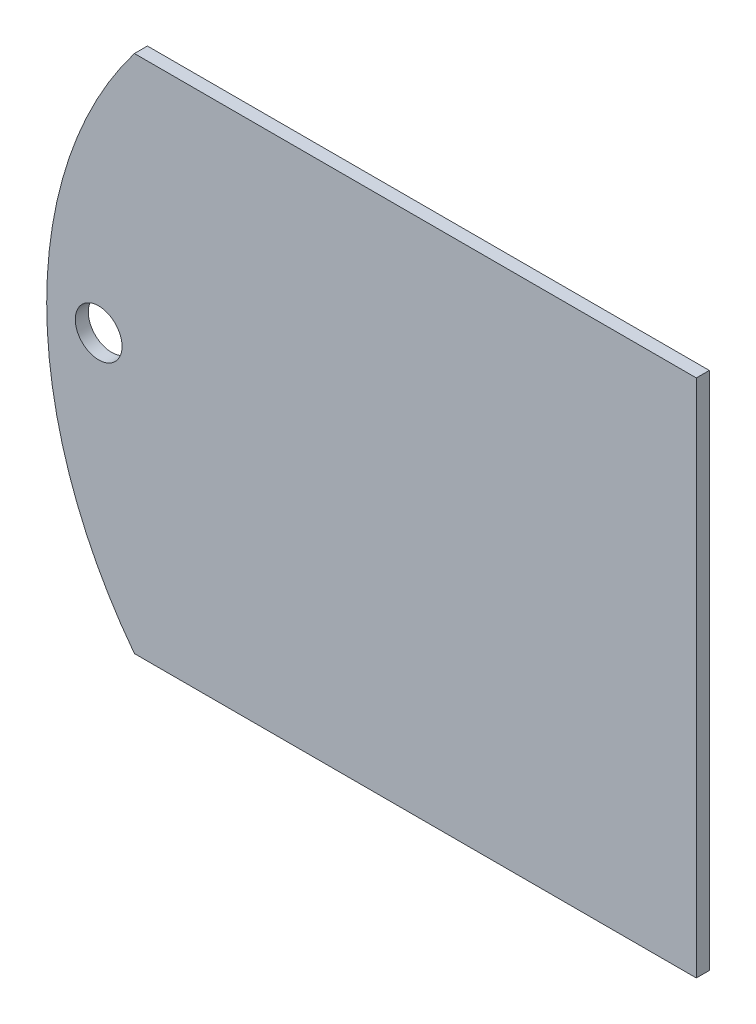
ISO-10303-21;
HEADER;
FILE_DESCRIPTION(('STEP AP214'),'2;1');
FILE_NAME('part.step','',(''),(''),'','','');
FILE_SCHEMA(('AUTOMOTIVE_DESIGN { 1 0 10303 214 1 1 1 1 }'));
ENDSEC;
DATA;
#1=APPLICATION_CONTEXT('core data for automotive mechanical design processes');
#2=APPLICATION_PROTOCOL_DEFINITION('international standard','automotive_design',2000,#1);
#3=PRODUCT_CONTEXT('',#1,'mechanical');
#4=PRODUCT('Part','Part','',(#3));
#5=PRODUCT_RELATED_PRODUCT_CATEGORY('part','',(#4));
#6=PRODUCT_DEFINITION_FORMATION('','',#4);
#7=PRODUCT_DEFINITION_CONTEXT('part definition',#1,'design');
#8=PRODUCT_DEFINITION('design','',#6,#7);
#9=PRODUCT_DEFINITION_SHAPE('','',#8);
#10=(LENGTH_UNIT() NAMED_UNIT(*) SI_UNIT(.MILLI.,.METRE.));
#11=(NAMED_UNIT(*) PLANE_ANGLE_UNIT() SI_UNIT($,.RADIAN.));
#12=(NAMED_UNIT(*) SI_UNIT($,.STERADIAN.) SOLID_ANGLE_UNIT());
#13=UNCERTAINTY_MEASURE_WITH_UNIT(LENGTH_MEASURE(1.E-05),#10,'distance_accuracy_value','');
#14=(GEOMETRIC_REPRESENTATION_CONTEXT(3) GLOBAL_UNCERTAINTY_ASSIGNED_CONTEXT((#13)) GLOBAL_UNIT_ASSIGNED_CONTEXT((#10,
#11,#12)) REPRESENTATION_CONTEXT('',''));
#15=CARTESIAN_POINT('',(0.,0.,0.));
#16=DIRECTION('',(0.,0.,1.));
#17=DIRECTION('',(1.,0.,0.));
#18=AXIS2_PLACEMENT_3D('',#15,#16,#17);
#19=CARTESIAN_POINT('',(0.,20.,1.));
#20=DIRECTION('',(0.,-1.,0.));
#21=DIRECTION('',(0.,0.,-1.));
#22=AXIS2_PLACEMENT_3D('',#19,#20,#21);
#23=PLANE('',#22);
#24=DIRECTION('',(-1.,0.,0.));
#25=VECTOR('',#24,1.);
#26=CARTESIAN_POINT('',(0.,20.,0.));
#27=LINE('',#26,#25);
#28=CARTESIAN_POINT('',(17.,20.,0.));
#29=VERTEX_POINT('',#28);
#30=CARTESIAN_POINT('',(-26.2488094968134,20.,0.));
#31=VERTEX_POINT('',#30);
#32=EDGE_CURVE('E103',#29,#31,#27,.T.);
#33=ORIENTED_EDGE('',*,*,#32,.T.);
#34=DIRECTION('',(0.,0.,-1.));
#35=VECTOR('',#34,1.);
#36=CARTESIAN_POINT('',(-26.2488094968134,20.,1.));
#37=LINE('',#36,#35);
#38=CARTESIAN_POINT('',(-26.2488094968134,20.,1.));
#39=VERTEX_POINT('',#38);
#40=EDGE_CURVE('E11',#39,#31,#37,.T.);
#41=ORIENTED_EDGE('',*,*,#40,.F.);
#42=DIRECTION('',(-1.,0.,0.));
#43=VECTOR('',#42,1.);
#44=CARTESIAN_POINT('',(0.,20.,1.));
#45=LINE('',#44,#43);
#46=CARTESIAN_POINT('',(17.,20.,1.));
#47=VERTEX_POINT('',#46);
#48=EDGE_CURVE('E88',#47,#39,#45,.T.);
#49=ORIENTED_EDGE('',*,*,#48,.F.);
#50=DIRECTION('',(0.,0.,-1.));
#51=VECTOR('',#50,1.);
#52=CARTESIAN_POINT('',(17.,20.,1.));
#53=LINE('',#52,#51);
#54=EDGE_CURVE('E96',#47,#29,#53,.T.);
#55=ORIENTED_EDGE('',*,*,#54,.T.);
#56=EDGE_LOOP('',(#33,#41,#49,#55));
#57=FACE_BOUND('',#56,.T.);
#58=ADVANCED_FACE('F36',(#57),#23,.F.);
#59=CARTESIAN_POINT('',(0.,0.,1.));
#60=DIRECTION('',(0.,0.,-1.));
#61=DIRECTION('',(-1.,0.,0.));
#62=AXIS2_PLACEMENT_3D('',#59,#60,#61);
#63=CYLINDRICAL_SURFACE('',#62,33.);
#64=CARTESIAN_POINT('',(0.,0.,0.));
#65=DIRECTION('',(0.,0.,1.));
#66=DIRECTION('',(1.,0.,0.));
#67=AXIS2_PLACEMENT_3D('',#64,#65,#66);
#68=CIRCLE('',#67,33.);
#69=CARTESIAN_POINT('',(-26.2488094968134,-20.,0.));
#70=VERTEX_POINT('',#69);
#71=EDGE_CURVE('E92',#31,#70,#68,.T.);
#72=ORIENTED_EDGE('',*,*,#71,.T.);
#73=DIRECTION('',(0.,0.,-1.));
#74=VECTOR('',#73,1.);
#75=CARTESIAN_POINT('',(-26.2488094968134,-20.,1.));
#76=LINE('',#75,#74);
#77=CARTESIAN_POINT('',(-26.2488094968134,-20.,1.));
#78=VERTEX_POINT('',#77);
#79=EDGE_CURVE('E45',#78,#70,#76,.T.);
#80=ORIENTED_EDGE('',*,*,#79,.F.);
#81=CARTESIAN_POINT('',(0.,0.,1.));
#82=DIRECTION('',(0.,0.,1.));
#83=DIRECTION('',(1.,0.,0.));
#84=AXIS2_PLACEMENT_3D('',#81,#82,#83);
#85=CIRCLE('',#84,33.);
#86=EDGE_CURVE('E83',#39,#78,#85,.T.);
#87=ORIENTED_EDGE('',*,*,#86,.F.);
#88=ORIENTED_EDGE('',*,*,#40,.T.);
#89=EDGE_LOOP('',(#72,#80,#87,#88));
#90=FACE_BOUND('',#89,.T.);
#91=ADVANCED_FACE('F91',(#90),#63,.T.);
#92=CARTESIAN_POINT('',(0.,-20.,1.));
#93=DIRECTION('',(0.,1.,0.));
#94=DIRECTION('',(0.,0.,1.));
#95=AXIS2_PLACEMENT_3D('',#92,#93,#94);
#96=PLANE('',#95);
#97=DIRECTION('',(1.,0.,0.));
#98=VECTOR('',#97,1.);
#99=CARTESIAN_POINT('',(0.,-20.,0.));
#100=LINE('',#99,#98);
#101=CARTESIAN_POINT('',(17.,-20.,0.));
#102=VERTEX_POINT('',#101);
#103=EDGE_CURVE('E70',#70,#102,#100,.T.);
#104=ORIENTED_EDGE('',*,*,#103,.T.);
#105=DIRECTION('',(0.,0.,-1.));
#106=VECTOR('',#105,1.);
#107=CARTESIAN_POINT('',(17.,-20.,1.));
#108=LINE('',#107,#106);
#109=CARTESIAN_POINT('',(17.,-20.,1.));
#110=VERTEX_POINT('',#109);
#111=EDGE_CURVE('E93',#110,#102,#108,.T.);
#112=ORIENTED_EDGE('',*,*,#111,.F.);
#113=DIRECTION('',(1.,0.,0.));
#114=VECTOR('',#113,1.);
#115=CARTESIAN_POINT('',(0.,-20.,1.));
#116=LINE('',#115,#114);
#117=EDGE_CURVE('E86',#78,#110,#116,.T.);
#118=ORIENTED_EDGE('',*,*,#117,.F.);
#119=ORIENTED_EDGE('',*,*,#79,.T.);
#120=EDGE_LOOP('',(#104,#112,#118,#119));
#121=FACE_BOUND('',#120,.T.);
#122=ADVANCED_FACE('F94',(#121),#96,.F.);
#123=CARTESIAN_POINT('',(-29.,0.,1.));
#124=DIRECTION('',(0.,0.,-1.));
#125=DIRECTION('',(-1.,0.,0.));
#126=AXIS2_PLACEMENT_3D('',#123,#124,#125);
#127=CYLINDRICAL_SURFACE('',#126,1.8);
#128=CARTESIAN_POINT('',(-29.,0.,1.));
#129=DIRECTION('',(0.,0.,1.));
#130=DIRECTION('',(1.,0.,0.));
#131=AXIS2_PLACEMENT_3D('',#128,#129,#130);
#132=CIRCLE('',#131,1.8);
#133=CARTESIAN_POINT('',(-27.2,0.,1.));
#134=VERTEX_POINT('',#133);
#135=EDGE_CURVE('E109',#134,#134,#132,.T.);
#136=ORIENTED_EDGE('',*,*,#135,.T.);
#137=EDGE_LOOP('',(#136));
#138=FACE_BOUND('',#137,.T.);
#139=CARTESIAN_POINT('',(-29.,0.,0.));
#140=DIRECTION('',(0.,0.,1.));
#141=DIRECTION('',(1.,0.,0.));
#142=AXIS2_PLACEMENT_3D('',#139,#140,#141);
#143=CIRCLE('',#142,1.8);
#144=CARTESIAN_POINT('',(-27.2,0.,0.));
#145=VERTEX_POINT('',#144);
#146=EDGE_CURVE('E100',#145,#145,#143,.T.);
#147=ORIENTED_EDGE('',*,*,#146,.F.);
#148=EDGE_LOOP('',(#147));
#149=FACE_BOUND('',#148,.T.);
#150=ADVANCED_FACE('F38',(#138,#149),#127,.F.);
#151=CARTESIAN_POINT('',(17.,0.,1.));
#152=DIRECTION('',(-1.,0.,0.));
#153=DIRECTION('',(0.,0.,1.));
#154=AXIS2_PLACEMENT_3D('',#151,#152,#153);
#155=PLANE('',#154);
#156=DIRECTION('',(0.,1.,0.));
#157=VECTOR('',#156,1.);
#158=CARTESIAN_POINT('',(17.,0.,0.));
#159=LINE('',#158,#157);
#160=EDGE_CURVE('E76',#102,#29,#159,.T.);
#161=ORIENTED_EDGE('',*,*,#160,.T.);
#162=ORIENTED_EDGE('',*,*,#54,.F.);
#163=DIRECTION('',(0.,1.,0.));
#164=VECTOR('',#163,1.);
#165=CARTESIAN_POINT('',(17.,0.,1.));
#166=LINE('',#165,#164);
#167=EDGE_CURVE('E53',#110,#47,#166,.T.);
#168=ORIENTED_EDGE('',*,*,#167,.F.);
#169=ORIENTED_EDGE('',*,*,#111,.T.);
#170=EDGE_LOOP('',(#161,#162,#168,#169));
#171=FACE_BOUND('',#170,.T.);
#172=ADVANCED_FACE('F111',(#171),#155,.F.);
#173=CARTESIAN_POINT('',(0.,0.,1.));
#174=DIRECTION('',(0.,0.,1.));
#175=DIRECTION('',(1.,0.,0.));
#176=AXIS2_PLACEMENT_3D('',#173,#174,#175);
#177=PLANE('',#176);
#178=ORIENTED_EDGE('',*,*,#135,.F.);
#179=EDGE_LOOP('',(#178));
#180=FACE_BOUND('',#179,.T.);
#181=ORIENTED_EDGE('',*,*,#48,.T.);
#182=ORIENTED_EDGE('',*,*,#86,.T.);
#183=ORIENTED_EDGE('',*,*,#117,.T.);
#184=ORIENTED_EDGE('',*,*,#167,.T.);
#185=EDGE_LOOP('',(#181,#182,#183,#184));
#186=FACE_BOUND('',#185,.T.);
#187=ADVANCED_FACE('F84',(#180,#186),#177,.T.);
#188=CARTESIAN_POINT('',(0.,0.,0.));
#189=DIRECTION('',(0.,0.,1.));
#190=DIRECTION('',(1.,0.,0.));
#191=AXIS2_PLACEMENT_3D('',#188,#189,#190);
#192=PLANE('',#191);
#193=ORIENTED_EDGE('',*,*,#146,.T.);
#194=EDGE_LOOP('',(#193));
#195=FACE_BOUND('',#194,.T.);
#196=ORIENTED_EDGE('',*,*,#32,.F.);
#197=ORIENTED_EDGE('',*,*,#160,.F.);
#198=ORIENTED_EDGE('',*,*,#103,.F.);
#199=ORIENTED_EDGE('',*,*,#71,.F.);
#200=EDGE_LOOP('',(#196,#197,#198,#199));
#201=FACE_BOUND('',#200,.T.);
#202=ADVANCED_FACE('F114',(#195,#201),#192,.F.);
#203=CLOSED_SHELL('',(#58,#91,#122,#150,#172,#187,#202));
#204=MANIFOLD_SOLID_BREP('B2',#203);
#205=ADVANCED_BREP_SHAPE_REPRESENTATION('',(#18,#204),#14);
#206=SHAPE_DEFINITION_REPRESENTATION(#9,#205);
ENDSEC;
END-ISO-10303-21;
